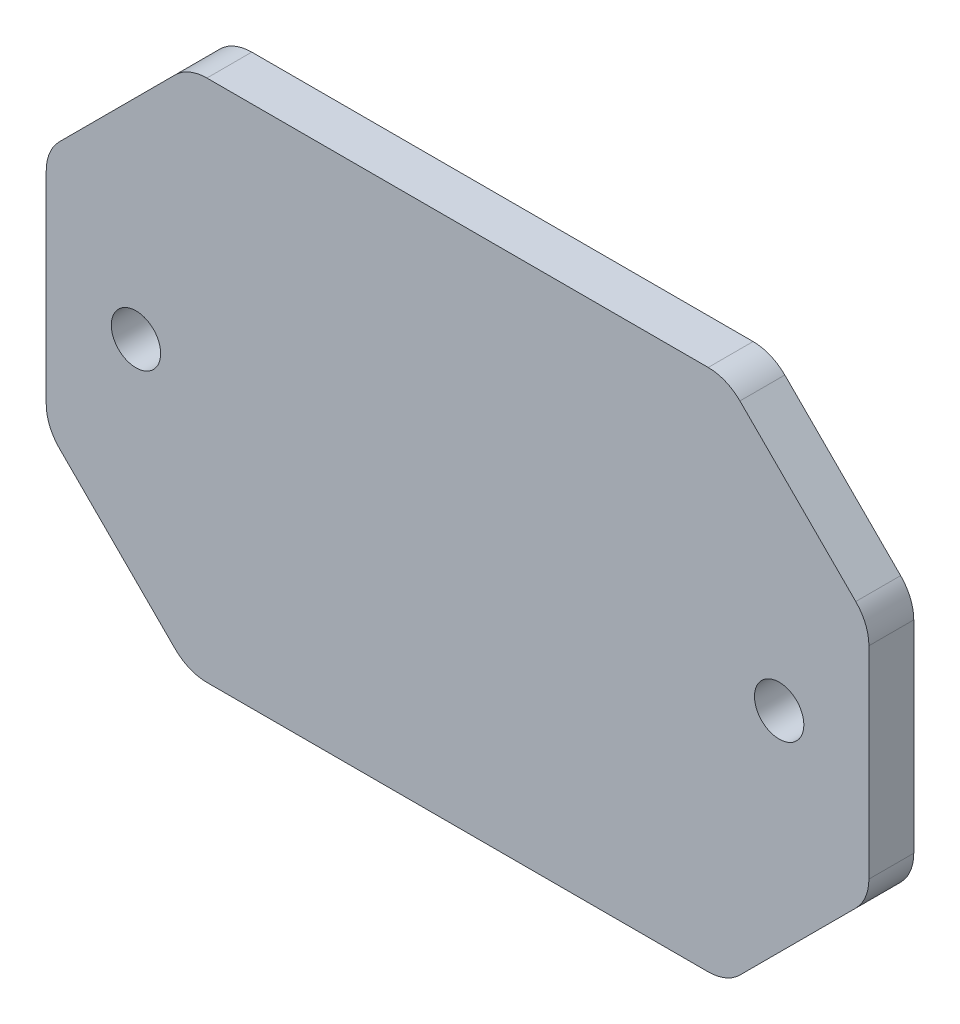
ISO-10303-21;
HEADER;
FILE_DESCRIPTION(('STEP AP214'),'2;1');
FILE_NAME('part.step','',(''),(''),'','','');
FILE_SCHEMA(('AUTOMOTIVE_DESIGN { 1 0 10303 214 1 1 1 1 }'));
ENDSEC;
DATA;
#1=APPLICATION_CONTEXT('core data for automotive mechanical design processes');
#2=APPLICATION_PROTOCOL_DEFINITION('international standard','automotive_design',2000,#1);
#3=PRODUCT_CONTEXT('',#1,'mechanical');
#4=PRODUCT('Part','Part','',(#3));
#5=PRODUCT_RELATED_PRODUCT_CATEGORY('part','',(#4));
#6=PRODUCT_DEFINITION_FORMATION('','',#4);
#7=PRODUCT_DEFINITION_CONTEXT('part definition',#1,'design');
#8=PRODUCT_DEFINITION('design','',#6,#7);
#9=PRODUCT_DEFINITION_SHAPE('','',#8);
#10=(LENGTH_UNIT() NAMED_UNIT(*) SI_UNIT(.MILLI.,.METRE.));
#11=(NAMED_UNIT(*) PLANE_ANGLE_UNIT() SI_UNIT($,.RADIAN.));
#12=(NAMED_UNIT(*) SI_UNIT($,.STERADIAN.) SOLID_ANGLE_UNIT());
#13=UNCERTAINTY_MEASURE_WITH_UNIT(LENGTH_MEASURE(1.E-05),#10,'distance_accuracy_value','');
#14=(GEOMETRIC_REPRESENTATION_CONTEXT(3) GLOBAL_UNCERTAINTY_ASSIGNED_CONTEXT((#13)) GLOBAL_UNIT_ASSIGNED_CONTEXT((#10,
#11,#12)) REPRESENTATION_CONTEXT('',''));
#15=CARTESIAN_POINT('',(0.,0.,0.));
#16=DIRECTION('',(0.,0.,1.));
#17=DIRECTION('',(1.,0.,0.));
#18=AXIS2_PLACEMENT_3D('',#15,#16,#17);
#19=CARTESIAN_POINT('',(27.5,17.4980916030534,3.));
#20=DIRECTION('',(-1.,0.,0.));
#21=DIRECTION('',(0.,-1.,0.));
#22=AXIS2_PLACEMENT_3D('',#19,#20,#21);
#23=PLANE('',#22);
#24=DIRECTION('',(0.,1.,0.));
#25=VECTOR('',#24,1.);
#26=CARTESIAN_POINT('',(27.5,17.4980916030534,3.));
#27=LINE('',#26,#25);
#28=CARTESIAN_POINT('',(27.5,-6.75545091593417,3.));
#29=VERTEX_POINT('',#28);
#30=CARTESIAN_POINT('',(27.5,6.75545091593413,3.));
#31=VERTEX_POINT('',#30);
#32=EDGE_CURVE('E269',#29,#31,#27,.T.);
#33=ORIENTED_EDGE('',*,*,#32,.F.);
#34=DIRECTION('',(0.,0.,1.));
#35=VECTOR('',#34,1.);
#36=CARTESIAN_POINT('',(27.5,-6.75545091593417,0.));
#37=LINE('',#36,#35);
#38=CARTESIAN_POINT('',(27.5,-6.75545091593417,0.));
#39=VERTEX_POINT('',#38);
#40=EDGE_CURVE('E224',#29,#39,#37,.F.);
#41=ORIENTED_EDGE('',*,*,#40,.T.);
#42=DIRECTION('',(0.,1.,0.));
#43=VECTOR('',#42,1.);
#44=CARTESIAN_POINT('',(27.5,17.4980916030534,0.));
#45=LINE('',#44,#43);
#46=CARTESIAN_POINT('',(27.5,6.75545091593413,0.));
#47=VERTEX_POINT('',#46);
#48=EDGE_CURVE('E291',#39,#47,#45,.T.);
#49=ORIENTED_EDGE('',*,*,#48,.T.);
#50=DIRECTION('',(0.,0.,-1.));
#51=VECTOR('',#50,1.);
#52=CARTESIAN_POINT('',(27.5,6.75545091593413,3.));
#53=LINE('',#52,#51);
#54=EDGE_CURVE('E221',#47,#31,#53,.F.);
#55=ORIENTED_EDGE('',*,*,#54,.T.);
#56=EDGE_LOOP('',(#33,#41,#49,#55));
#57=FACE_BOUND('',#56,.T.);
#58=ADVANCED_FACE('F36',(#57),#23,.F.);
#59=CARTESIAN_POINT('',(-27.5,17.4980916030534,3.));
#60=DIRECTION('',(0.,-1.,0.));
#61=DIRECTION('',(0.,0.,-1.));
#62=AXIS2_PLACEMENT_3D('',#59,#60,#61);
#63=PLANE('',#62);
#64=DIRECTION('',(-1.,0.,0.));
#65=VECTOR('',#64,1.);
#66=CARTESIAN_POINT('',(-27.5,17.4980916030534,3.));
#67=LINE('',#66,#65);
#68=CARTESIAN_POINT('',(16.7573593128807,17.4980916030534,3.));
#69=VERTEX_POINT('',#68);
#70=CARTESIAN_POINT('',(-16.7573593128807,17.4980916030534,3.));
#71=VERTEX_POINT('',#70);
#72=EDGE_CURVE('E173',#69,#71,#67,.T.);
#73=ORIENTED_EDGE('',*,*,#72,.F.);
#74=DIRECTION('',(0.,0.,1.));
#75=VECTOR('',#74,1.);
#76=CARTESIAN_POINT('',(16.7573593128807,17.4980916030534,0.));
#77=LINE('',#76,#75);
#78=CARTESIAN_POINT('',(16.7573593128807,17.4980916030534,0.));
#79=VERTEX_POINT('',#78);
#80=EDGE_CURVE('E234',#69,#79,#77,.F.);
#81=ORIENTED_EDGE('',*,*,#80,.T.);
#82=DIRECTION('',(-1.,0.,0.));
#83=VECTOR('',#82,1.);
#84=CARTESIAN_POINT('',(-27.5,17.4980916030534,0.));
#85=LINE('',#84,#83);
#86=CARTESIAN_POINT('',(-16.7573593128807,17.4980916030534,0.));
#87=VERTEX_POINT('',#86);
#88=EDGE_CURVE('E274',#79,#87,#85,.T.);
#89=ORIENTED_EDGE('',*,*,#88,.T.);
#90=DIRECTION('',(0.,0.,-1.));
#91=VECTOR('',#90,1.);
#92=CARTESIAN_POINT('',(-16.7573593128807,17.4980916030534,3.));
#93=LINE('',#92,#91);
#94=EDGE_CURVE('E231',#87,#71,#93,.F.);
#95=ORIENTED_EDGE('',*,*,#94,.T.);
#96=EDGE_LOOP('',(#73,#81,#89,#95));
#97=FACE_BOUND('',#96,.T.);
#98=ADVANCED_FACE('F299',(#97),#63,.F.);
#99=CARTESIAN_POINT('',(-27.5,17.4980916030534,3.));
#100=DIRECTION('',(1.,0.,0.));
#101=DIRECTION('',(0.,1.,0.));
#102=AXIS2_PLACEMENT_3D('',#99,#100,#101);
#103=PLANE('',#102);
#104=DIRECTION('',(0.,-1.,0.));
#105=VECTOR('',#104,1.);
#106=CARTESIAN_POINT('',(-27.5,17.4980916030534,0.));
#107=LINE('',#106,#105);
#108=CARTESIAN_POINT('',(-27.5,6.75545091593416,0.));
#109=VERTEX_POINT('',#108);
#110=CARTESIAN_POINT('',(-27.5,-6.75545091593414,0.));
#111=VERTEX_POINT('',#110);
#112=EDGE_CURVE('E270',#109,#111,#107,.T.);
#113=ORIENTED_EDGE('',*,*,#112,.T.);
#114=DIRECTION('',(0.,0.,-1.));
#115=VECTOR('',#114,1.);
#116=CARTESIAN_POINT('',(-27.5,-6.75545091593414,3.));
#117=LINE('',#116,#115);
#118=CARTESIAN_POINT('',(-27.5,-6.75545091593414,3.));
#119=VERTEX_POINT('',#118);
#120=EDGE_CURVE('E162',#111,#119,#117,.F.);
#121=ORIENTED_EDGE('',*,*,#120,.T.);
#122=DIRECTION('',(0.,-1.,0.));
#123=VECTOR('',#122,1.);
#124=CARTESIAN_POINT('',(-27.5,17.4980916030534,3.));
#125=LINE('',#124,#123);
#126=CARTESIAN_POINT('',(-27.5,6.75545091593416,3.));
#127=VERTEX_POINT('',#126);
#128=EDGE_CURVE('E155',#127,#119,#125,.T.);
#129=ORIENTED_EDGE('',*,*,#128,.F.);
#130=DIRECTION('',(0.,0.,1.));
#131=VECTOR('',#130,1.);
#132=CARTESIAN_POINT('',(-27.5,6.75545091593416,0.));
#133=LINE('',#132,#131);
#134=EDGE_CURVE('E169',#127,#109,#133,.F.);
#135=ORIENTED_EDGE('',*,*,#134,.T.);
#136=EDGE_LOOP('',(#113,#121,#129,#135));
#137=FACE_BOUND('',#136,.T.);
#138=ADVANCED_FACE('F168',(#137),#103,.F.);
#139=CARTESIAN_POINT('',(-27.5,-17.4980916030535,3.));
#140=DIRECTION('',(0.,1.,0.));
#141=DIRECTION('',(0.,0.,1.));
#142=AXIS2_PLACEMENT_3D('',#139,#140,#141);
#143=PLANE('',#142);
#144=DIRECTION('',(1.,0.,0.));
#145=VECTOR('',#144,1.);
#146=CARTESIAN_POINT('',(-27.5,-17.4980916030535,3.));
#147=LINE('',#146,#145);
#148=CARTESIAN_POINT('',(-16.7573593128807,-17.4980916030535,3.));
#149=VERTEX_POINT('',#148);
#150=CARTESIAN_POINT('',(16.7573593128807,-17.4980916030535,3.));
#151=VERTEX_POINT('',#150);
#152=EDGE_CURVE('E172',#149,#151,#147,.T.);
#153=ORIENTED_EDGE('',*,*,#152,.F.);
#154=DIRECTION('',(0.,0.,1.));
#155=VECTOR('',#154,1.);
#156=CARTESIAN_POINT('',(-16.7573593128807,-17.4980916030535,0.));
#157=LINE('',#156,#155);
#158=CARTESIAN_POINT('',(-16.7573593128807,-17.4980916030535,0.));
#159=VERTEX_POINT('',#158);
#160=EDGE_CURVE('E215',#149,#159,#157,.F.);
#161=ORIENTED_EDGE('',*,*,#160,.T.);
#162=DIRECTION('',(1.,0.,0.));
#163=VECTOR('',#162,1.);
#164=CARTESIAN_POINT('',(-27.5,-17.4980916030535,0.));
#165=LINE('',#164,#163);
#166=CARTESIAN_POINT('',(16.7573593128807,-17.4980916030535,0.));
#167=VERTEX_POINT('',#166);
#168=EDGE_CURVE('E265',#159,#167,#165,.T.);
#169=ORIENTED_EDGE('',*,*,#168,.T.);
#170=DIRECTION('',(0.,0.,-1.));
#171=VECTOR('',#170,1.);
#172=CARTESIAN_POINT('',(16.7573593128807,-17.4980916030535,3.));
#173=LINE('',#172,#171);
#174=EDGE_CURVE('E212',#167,#151,#173,.F.);
#175=ORIENTED_EDGE('',*,*,#174,.T.);
#176=EDGE_LOOP('',(#153,#161,#169,#175));
#177=FACE_BOUND('',#176,.T.);
#178=ADVANCED_FACE('F264',(#177),#143,.F.);
#179=CARTESIAN_POINT('',(0.,0.,3.));
#180=DIRECTION('',(0.,0.,1.));
#181=DIRECTION('',(1.,0.,0.));
#182=AXIS2_PLACEMENT_3D('',#179,#180,#181);
#183=PLANE('',#182);
#184=CARTESIAN_POINT('',(-21.5,0.,3.));
#185=DIRECTION('',(0.,0.,1.));
#186=DIRECTION('',(1.,0.,0.));
#187=AXIS2_PLACEMENT_3D('',#184,#185,#186);
#188=CIRCLE('',#187,1.65);
#189=CARTESIAN_POINT('',(-19.85,0.,3.));
#190=VERTEX_POINT('',#189);
#191=EDGE_CURVE('E312',#190,#190,#188,.T.);
#192=ORIENTED_EDGE('',*,*,#191,.F.);
#193=EDGE_LOOP('',(#192));
#194=FACE_BOUND('',#193,.T.);
#195=CARTESIAN_POINT('',(21.5,0.,3.));
#196=DIRECTION('',(0.,0.,1.));
#197=DIRECTION('',(1.,0.,0.));
#198=AXIS2_PLACEMENT_3D('',#195,#196,#197);
#199=CIRCLE('',#198,1.65);
#200=CARTESIAN_POINT('',(23.15,0.,3.));
#201=VERTEX_POINT('',#200);
#202=EDGE_CURVE('E306',#201,#201,#199,.T.);
#203=ORIENTED_EDGE('',*,*,#202,.F.);
#204=EDGE_LOOP('',(#203));
#205=FACE_BOUND('',#204,.T.);
#206=ORIENTED_EDGE('',*,*,#128,.T.);
#207=CARTESIAN_POINT('',(-24.5,-6.75545091593414,3.));
#208=DIRECTION('',(0.,0.,1.));
#209=DIRECTION('',(1.,0.,0.));
#210=AXIS2_PLACEMENT_3D('',#207,#208,#209);
#211=CIRCLE('',#210,3.);
#212=CARTESIAN_POINT('',(-26.6213203435596,-8.87677125949378,3.));
#213=VERTEX_POINT('',#212);
#214=EDGE_CURVE('E193',#119,#213,#211,.T.);
#215=ORIENTED_EDGE('',*,*,#214,.T.);
#216=DIRECTION('',(-0.707106781186547,0.707106781186549,0.));
#217=VECTOR('',#216,1.);
#218=CARTESIAN_POINT('',(-17.7490458015267,-17.7490458015267,3.));
#219=LINE('',#218,#217);
#220=CARTESIAN_POINT('',(-18.8786796564403,-16.6194119466131,3.));
#221=VERTEX_POINT('',#220);
#222=EDGE_CURVE('E178',#213,#221,#219,.F.);
#223=ORIENTED_EDGE('',*,*,#222,.T.);
#224=CARTESIAN_POINT('',(-16.7573593128807,-14.4980916030535,3.));
#225=DIRECTION('',(0.,0.,1.));
#226=DIRECTION('',(1.,0.,0.));
#227=AXIS2_PLACEMENT_3D('',#224,#225,#226);
#228=CIRCLE('',#227,3.);
#229=EDGE_CURVE('E191',#221,#149,#228,.T.);
#230=ORIENTED_EDGE('',*,*,#229,.T.);
#231=ORIENTED_EDGE('',*,*,#152,.T.);
#232=CARTESIAN_POINT('',(16.7573593128807,-14.4980916030535,3.));
#233=DIRECTION('',(0.,0.,1.));
#234=DIRECTION('',(1.,0.,0.));
#235=AXIS2_PLACEMENT_3D('',#232,#233,#234);
#236=CIRCLE('',#235,3.);
#237=CARTESIAN_POINT('',(18.8786796564403,-16.6194119466131,3.));
#238=VERTEX_POINT('',#237);
#239=EDGE_CURVE('E189',#151,#238,#236,.T.);
#240=ORIENTED_EDGE('',*,*,#239,.T.);
#241=DIRECTION('',(-0.707106781186549,-0.707106781186546,0.));
#242=VECTOR('',#241,1.);
#243=CARTESIAN_POINT('',(17.7490458015267,-17.7490458015267,3.));
#244=LINE('',#243,#242);
#245=CARTESIAN_POINT('',(26.6213203435596,-8.87677125949381,3.));
#246=VERTEX_POINT('',#245);
#247=EDGE_CURVE('E247',#238,#246,#244,.F.);
#248=ORIENTED_EDGE('',*,*,#247,.T.);
#249=CARTESIAN_POINT('',(24.5,-6.75545091593417,3.));
#250=DIRECTION('',(0.,0.,1.));
#251=DIRECTION('',(1.,0.,0.));
#252=AXIS2_PLACEMENT_3D('',#249,#250,#251);
#253=CIRCLE('',#252,3.);
#254=EDGE_CURVE('E187',#246,#29,#253,.T.);
#255=ORIENTED_EDGE('',*,*,#254,.T.);
#256=ORIENTED_EDGE('',*,*,#32,.T.);
#257=CARTESIAN_POINT('',(24.5,6.75545091593412,3.));
#258=DIRECTION('',(0.,0.,1.));
#259=DIRECTION('',(1.,0.,0.));
#260=AXIS2_PLACEMENT_3D('',#257,#258,#259);
#261=CIRCLE('',#260,3.);
#262=CARTESIAN_POINT('',(26.6213203435597,8.87677125949376,3.));
#263=VERTEX_POINT('',#262);
#264=EDGE_CURVE('E185',#31,#263,#261,.T.);
#265=ORIENTED_EDGE('',*,*,#264,.T.);
#266=DIRECTION('',(0.707106781186546,-0.707106781186549,0.));
#267=VECTOR('',#266,1.);
#268=CARTESIAN_POINT('',(17.7490458015268,17.7490458015267,3.));
#269=LINE('',#268,#267);
#270=CARTESIAN_POINT('',(18.8786796564404,16.6194119466131,3.));
#271=VERTEX_POINT('',#270);
#272=EDGE_CURVE('E243',#263,#271,#269,.F.);
#273=ORIENTED_EDGE('',*,*,#272,.T.);
#274=CARTESIAN_POINT('',(16.7573593128807,14.4980916030534,3.));
#275=DIRECTION('',(0.,0.,1.));
#276=DIRECTION('',(1.,0.,0.));
#277=AXIS2_PLACEMENT_3D('',#274,#275,#276);
#278=CIRCLE('',#277,3.);
#279=EDGE_CURVE('E183',#271,#69,#278,.T.);
#280=ORIENTED_EDGE('',*,*,#279,.T.);
#281=ORIENTED_EDGE('',*,*,#72,.T.);
#282=CARTESIAN_POINT('',(-16.7573593128807,14.4980916030534,3.));
#283=DIRECTION('',(0.,0.,1.));
#284=DIRECTION('',(1.,0.,0.));
#285=AXIS2_PLACEMENT_3D('',#282,#283,#284);
#286=CIRCLE('',#285,3.);
#287=CARTESIAN_POINT('',(-18.8786796564403,16.6194119466131,3.));
#288=VERTEX_POINT('',#287);
#289=EDGE_CURVE('E161',#71,#288,#286,.T.);
#290=ORIENTED_EDGE('',*,*,#289,.T.);
#291=DIRECTION('',(0.707106781186549,0.707106781186546,0.));
#292=VECTOR('',#291,1.);
#293=CARTESIAN_POINT('',(-17.7490458015267,17.7490458015267,3.));
#294=LINE('',#293,#292);
#295=CARTESIAN_POINT('',(-26.6213203435596,8.87677125949381,3.));
#296=VERTEX_POINT('',#295);
#297=EDGE_CURVE('E157',#288,#296,#294,.F.);
#298=ORIENTED_EDGE('',*,*,#297,.T.);
#299=CARTESIAN_POINT('',(-24.5,6.75545091593416,3.));
#300=DIRECTION('',(0.,0.,1.));
#301=DIRECTION('',(1.,0.,0.));
#302=AXIS2_PLACEMENT_3D('',#299,#300,#301);
#303=CIRCLE('',#302,3.);
#304=EDGE_CURVE('E152',#296,#127,#303,.T.);
#305=ORIENTED_EDGE('',*,*,#304,.T.);
#306=EDGE_LOOP('',(#206,#215,#223,#230,#231,#240,#248,#255,#256,#265,#273,#280,#281,#290,#298,#305));
#307=FACE_BOUND('',#306,.T.);
#308=ADVANCED_FACE('F154',(#194,#205,#307),#183,.T.);
#309=CARTESIAN_POINT('',(0.,0.,0.));
#310=DIRECTION('',(0.,0.,1.));
#311=DIRECTION('',(1.,0.,0.));
#312=AXIS2_PLACEMENT_3D('',#309,#310,#311);
#313=PLANE('',#312);
#314=CARTESIAN_POINT('',(-21.5,0.,0.));
#315=DIRECTION('',(0.,0.,1.));
#316=DIRECTION('',(1.,0.,0.));
#317=AXIS2_PLACEMENT_3D('',#314,#315,#316);
#318=CIRCLE('',#317,1.65);
#319=CARTESIAN_POINT('',(-19.85,0.,0.));
#320=VERTEX_POINT('',#319);
#321=EDGE_CURVE('E293',#320,#320,#318,.T.);
#322=ORIENTED_EDGE('',*,*,#321,.T.);
#323=EDGE_LOOP('',(#322));
#324=FACE_BOUND('',#323,.T.);
#325=CARTESIAN_POINT('',(21.5,0.,0.));
#326=DIRECTION('',(0.,0.,1.));
#327=DIRECTION('',(1.,0.,0.));
#328=AXIS2_PLACEMENT_3D('',#325,#326,#327);
#329=CIRCLE('',#328,1.65);
#330=CARTESIAN_POINT('',(23.15,0.,0.));
#331=VERTEX_POINT('',#330);
#332=EDGE_CURVE('E309',#331,#331,#329,.T.);
#333=ORIENTED_EDGE('',*,*,#332,.T.);
#334=EDGE_LOOP('',(#333));
#335=FACE_BOUND('',#334,.T.);
#336=DIRECTION('',(0.707106781186547,-0.707106781186549,0.));
#337=VECTOR('',#336,1.);
#338=CARTESIAN_POINT('',(-18.,-17.4980916030535,0.));
#339=LINE('',#338,#337);
#340=CARTESIAN_POINT('',(-18.8786796564403,-16.6194119466131,0.));
#341=VERTEX_POINT('',#340);
#342=CARTESIAN_POINT('',(-26.6213203435596,-8.87677125949378,0.));
#343=VERTEX_POINT('',#342);
#344=EDGE_CURVE('E244',#341,#343,#339,.F.);
#345=ORIENTED_EDGE('',*,*,#344,.T.);
#346=CARTESIAN_POINT('',(-24.5,-6.75545091593414,0.));
#347=DIRECTION('',(0.,0.,1.));
#348=DIRECTION('',(1.,0.,0.));
#349=AXIS2_PLACEMENT_3D('',#346,#347,#348);
#350=CIRCLE('',#349,3.);
#351=EDGE_CURVE('E210',#343,#111,#350,.F.);
#352=ORIENTED_EDGE('',*,*,#351,.T.);
#353=ORIENTED_EDGE('',*,*,#112,.F.);
#354=CARTESIAN_POINT('',(-24.5,6.75545091593416,0.));
#355=DIRECTION('',(0.,0.,1.));
#356=DIRECTION('',(1.,0.,0.));
#357=AXIS2_PLACEMENT_3D('',#354,#355,#356);
#358=CIRCLE('',#357,3.);
#359=CARTESIAN_POINT('',(-26.6213203435596,8.8767712594938,0.));
#360=VERTEX_POINT('',#359);
#361=EDGE_CURVE('E175',#109,#360,#358,.F.);
#362=ORIENTED_EDGE('',*,*,#361,.T.);
#363=DIRECTION('',(-0.707106781186549,-0.707106781186546,0.));
#364=VECTOR('',#363,1.);
#365=CARTESIAN_POINT('',(-27.5,7.99809160305345,0.));
#366=LINE('',#365,#364);
#367=CARTESIAN_POINT('',(-18.8786796564403,16.6194119466131,0.));
#368=VERTEX_POINT('',#367);
#369=EDGE_CURVE('E241',#360,#368,#366,.F.);
#370=ORIENTED_EDGE('',*,*,#369,.T.);
#371=CARTESIAN_POINT('',(-16.7573593128807,14.4980916030534,0.));
#372=DIRECTION('',(0.,0.,1.));
#373=DIRECTION('',(1.,0.,0.));
#374=AXIS2_PLACEMENT_3D('',#371,#372,#373);
#375=CIRCLE('',#374,3.);
#376=EDGE_CURVE('E200',#368,#87,#375,.F.);
#377=ORIENTED_EDGE('',*,*,#376,.T.);
#378=ORIENTED_EDGE('',*,*,#88,.F.);
#379=CARTESIAN_POINT('',(16.7573593128807,14.4980916030534,0.));
#380=DIRECTION('',(0.,0.,1.));
#381=DIRECTION('',(1.,0.,0.));
#382=AXIS2_PLACEMENT_3D('',#379,#380,#381);
#383=CIRCLE('',#382,3.);
#384=CARTESIAN_POINT('',(18.8786796564404,16.6194119466131,0.));
#385=VERTEX_POINT('',#384);
#386=EDGE_CURVE('E202',#79,#385,#383,.F.);
#387=ORIENTED_EDGE('',*,*,#386,.T.);
#388=DIRECTION('',(-0.707106781186546,0.707106781186549,0.));
#389=VECTOR('',#388,1.);
#390=CARTESIAN_POINT('',(18.,17.4980916030534,0.));
#391=LINE('',#390,#389);
#392=CARTESIAN_POINT('',(26.6213203435597,8.87677125949376,0.));
#393=VERTEX_POINT('',#392);
#394=EDGE_CURVE('E278',#385,#393,#391,.F.);
#395=ORIENTED_EDGE('',*,*,#394,.T.);
#396=CARTESIAN_POINT('',(24.5,6.75545091593412,0.));
#397=DIRECTION('',(0.,0.,1.));
#398=DIRECTION('',(1.,0.,0.));
#399=AXIS2_PLACEMENT_3D('',#396,#397,#398);
#400=CIRCLE('',#399,3.);
#401=EDGE_CURVE('E204',#393,#47,#400,.F.);
#402=ORIENTED_EDGE('',*,*,#401,.T.);
#403=ORIENTED_EDGE('',*,*,#48,.F.);
#404=CARTESIAN_POINT('',(24.5,-6.75545091593417,0.));
#405=DIRECTION('',(0.,0.,1.));
#406=DIRECTION('',(1.,0.,0.));
#407=AXIS2_PLACEMENT_3D('',#404,#405,#406);
#408=CIRCLE('',#407,3.);
#409=CARTESIAN_POINT('',(26.6213203435596,-8.87677125949382,0.));
#410=VERTEX_POINT('',#409);
#411=EDGE_CURVE('E206',#39,#410,#408,.F.);
#412=ORIENTED_EDGE('',*,*,#411,.T.);
#413=DIRECTION('',(0.707106781186549,0.707106781186546,0.));
#414=VECTOR('',#413,1.);
#415=CARTESIAN_POINT('',(27.5,-7.99809160305346,0.));
#416=LINE('',#415,#414);
#417=CARTESIAN_POINT('',(18.8786796564403,-16.6194119466131,0.));
#418=VERTEX_POINT('',#417);
#419=EDGE_CURVE('E250',#410,#418,#416,.F.);
#420=ORIENTED_EDGE('',*,*,#419,.T.);
#421=CARTESIAN_POINT('',(16.7573593128807,-14.4980916030535,0.));
#422=DIRECTION('',(0.,0.,1.));
#423=DIRECTION('',(1.,0.,0.));
#424=AXIS2_PLACEMENT_3D('',#421,#422,#423);
#425=CIRCLE('',#424,3.);
#426=EDGE_CURVE('E51',#418,#167,#425,.F.);
#427=ORIENTED_EDGE('',*,*,#426,.T.);
#428=ORIENTED_EDGE('',*,*,#168,.F.);
#429=CARTESIAN_POINT('',(-16.7573593128807,-14.4980916030535,0.));
#430=DIRECTION('',(0.,0.,1.));
#431=DIRECTION('',(1.,0.,0.));
#432=AXIS2_PLACEMENT_3D('',#429,#430,#431);
#433=CIRCLE('',#432,3.);
#434=EDGE_CURVE('E59',#159,#341,#433,.F.);
#435=ORIENTED_EDGE('',*,*,#434,.T.);
#436=EDGE_LOOP('',(#345,#352,#353,#362,#370,#377,#378,#387,#395,#402,#403,#412,#420,#427,#428,#435));
#437=FACE_BOUND('',#436,.T.);
#438=ADVANCED_FACE('F267',(#324,#335,#437),#313,.F.);
#439=CARTESIAN_POINT('',(-27.5,7.99809160305345,3.));
#440=DIRECTION('',(0.707106781186546,-0.707106781186549,0.));
#441=DIRECTION('',(0.,0.,-1.));
#442=AXIS2_PLACEMENT_3D('',#439,#440,#441);
#443=PLANE('',#442);
#444=ORIENTED_EDGE('',*,*,#297,.F.);
#445=DIRECTION('',(0.,0.,1.));
#446=VECTOR('',#445,1.);
#447=CARTESIAN_POINT('',(-18.8786796564403,16.6194119466131,0.));
#448=LINE('',#447,#446);
#449=EDGE_CURVE('E11',#288,#368,#448,.F.);
#450=ORIENTED_EDGE('',*,*,#449,.T.);
#451=ORIENTED_EDGE('',*,*,#369,.F.);
#452=DIRECTION('',(0.,0.,-1.));
#453=VECTOR('',#452,1.);
#454=CARTESIAN_POINT('',(-26.6213203435596,8.8767712594938,3.));
#455=LINE('',#454,#453);
#456=EDGE_CURVE('E44',#360,#296,#455,.F.);
#457=ORIENTED_EDGE('',*,*,#456,.T.);
#458=EDGE_LOOP('',(#444,#450,#451,#457));
#459=FACE_BOUND('',#458,.T.);
#460=ADVANCED_FACE('F238',(#459),#443,.F.);
#461=CARTESIAN_POINT('',(-18.,-17.4980916030535,3.));
#462=DIRECTION('',(0.707106781186548,0.707106781186546,0.));
#463=DIRECTION('',(0.,0.,-1.));
#464=AXIS2_PLACEMENT_3D('',#461,#462,#463);
#465=PLANE('',#464);
#466=ORIENTED_EDGE('',*,*,#222,.F.);
#467=DIRECTION('',(0.,0.,1.));
#468=VECTOR('',#467,1.);
#469=CARTESIAN_POINT('',(-26.6213203435596,-8.87677125949378,0.));
#470=LINE('',#469,#468);
#471=EDGE_CURVE('E197',#213,#343,#470,.F.);
#472=ORIENTED_EDGE('',*,*,#471,.T.);
#473=ORIENTED_EDGE('',*,*,#344,.F.);
#474=DIRECTION('',(0.,0.,-1.));
#475=VECTOR('',#474,1.);
#476=CARTESIAN_POINT('',(-18.8786796564403,-16.6194119466131,3.));
#477=LINE('',#476,#475);
#478=EDGE_CURVE('E195',#341,#221,#477,.F.);
#479=ORIENTED_EDGE('',*,*,#478,.T.);
#480=EDGE_LOOP('',(#466,#472,#473,#479));
#481=FACE_BOUND('',#480,.T.);
#482=ADVANCED_FACE('F355',(#481),#465,.F.);
#483=CARTESIAN_POINT('',(27.5,-7.99809160305346,3.));
#484=DIRECTION('',(-0.707106781186546,0.707106781186549,0.));
#485=DIRECTION('',(0.,0.,-1.));
#486=AXIS2_PLACEMENT_3D('',#483,#484,#485);
#487=PLANE('',#486);
#488=ORIENTED_EDGE('',*,*,#247,.F.);
#489=DIRECTION('',(0.,0.,1.));
#490=VECTOR('',#489,1.);
#491=CARTESIAN_POINT('',(18.8786796564403,-16.6194119466131,0.));
#492=LINE('',#491,#490);
#493=EDGE_CURVE('E219',#238,#418,#492,.F.);
#494=ORIENTED_EDGE('',*,*,#493,.T.);
#495=ORIENTED_EDGE('',*,*,#419,.F.);
#496=DIRECTION('',(0.,0.,-1.));
#497=VECTOR('',#496,1.);
#498=CARTESIAN_POINT('',(26.6213203435596,-8.87677125949382,3.));
#499=LINE('',#498,#497);
#500=EDGE_CURVE('E217',#410,#246,#499,.F.);
#501=ORIENTED_EDGE('',*,*,#500,.T.);
#502=EDGE_LOOP('',(#488,#494,#495,#501));
#503=FACE_BOUND('',#502,.T.);
#504=ADVANCED_FACE('F361',(#503),#487,.F.);
#505=CARTESIAN_POINT('',(18.,17.4980916030534,3.));
#506=DIRECTION('',(-0.707106781186549,-0.707106781186546,0.));
#507=DIRECTION('',(0.,0.,-1.));
#508=AXIS2_PLACEMENT_3D('',#505,#506,#507);
#509=PLANE('',#508);
#510=ORIENTED_EDGE('',*,*,#272,.F.);
#511=DIRECTION('',(0.,0.,1.));
#512=VECTOR('',#511,1.);
#513=CARTESIAN_POINT('',(26.6213203435597,8.87677125949376,0.));
#514=LINE('',#513,#512);
#515=EDGE_CURVE('E229',#263,#393,#514,.F.);
#516=ORIENTED_EDGE('',*,*,#515,.T.);
#517=ORIENTED_EDGE('',*,*,#394,.F.);
#518=DIRECTION('',(0.,0.,-1.));
#519=VECTOR('',#518,1.);
#520=CARTESIAN_POINT('',(18.8786796564404,16.6194119466131,3.));
#521=LINE('',#520,#519);
#522=EDGE_CURVE('E227',#385,#271,#521,.F.);
#523=ORIENTED_EDGE('',*,*,#522,.T.);
#524=EDGE_LOOP('',(#510,#516,#517,#523));
#525=FACE_BOUND('',#524,.T.);
#526=ADVANCED_FACE('F367',(#525),#509,.F.);
#527=CARTESIAN_POINT('',(-24.5,-6.75545091593414,3.));
#528=DIRECTION('',(0.,0.,1.));
#529=DIRECTION('',(1.,0.,0.));
#530=AXIS2_PLACEMENT_3D('',#527,#528,#529);
#531=CYLINDRICAL_SURFACE('',#530,3.);
#532=ORIENTED_EDGE('',*,*,#351,.F.);
#533=ORIENTED_EDGE('',*,*,#471,.F.);
#534=ORIENTED_EDGE('',*,*,#214,.F.);
#535=ORIENTED_EDGE('',*,*,#120,.F.);
#536=EDGE_LOOP('',(#532,#533,#534,#535));
#537=FACE_BOUND('',#536,.T.);
#538=ADVANCED_FACE('F372',(#537),#531,.T.);
#539=CARTESIAN_POINT('',(-16.7573593128807,-14.4980916030535,3.));
#540=DIRECTION('',(0.,0.,-1.));
#541=DIRECTION('',(-1.,0.,0.));
#542=AXIS2_PLACEMENT_3D('',#539,#540,#541);
#543=CYLINDRICAL_SURFACE('',#542,3.);
#544=ORIENTED_EDGE('',*,*,#229,.F.);
#545=ORIENTED_EDGE('',*,*,#478,.F.);
#546=ORIENTED_EDGE('',*,*,#434,.F.);
#547=ORIENTED_EDGE('',*,*,#160,.F.);
#548=EDGE_LOOP('',(#544,#545,#546,#547));
#549=FACE_BOUND('',#548,.T.);
#550=ADVANCED_FACE('F262',(#549),#543,.T.);
#551=CARTESIAN_POINT('',(16.7573593128807,-14.4980916030535,3.));
#552=DIRECTION('',(0.,0.,1.));
#553=DIRECTION('',(1.,0.,0.));
#554=AXIS2_PLACEMENT_3D('',#551,#552,#553);
#555=CYLINDRICAL_SURFACE('',#554,3.);
#556=ORIENTED_EDGE('',*,*,#426,.F.);
#557=ORIENTED_EDGE('',*,*,#493,.F.);
#558=ORIENTED_EDGE('',*,*,#239,.F.);
#559=ORIENTED_EDGE('',*,*,#174,.F.);
#560=EDGE_LOOP('',(#556,#557,#558,#559));
#561=FACE_BOUND('',#560,.T.);
#562=ADVANCED_FACE('F286',(#561),#555,.T.);
#563=CARTESIAN_POINT('',(24.5,-6.75545091593417,3.));
#564=DIRECTION('',(0.,0.,-1.));
#565=DIRECTION('',(-1.,0.,0.));
#566=AXIS2_PLACEMENT_3D('',#563,#564,#565);
#567=CYLINDRICAL_SURFACE('',#566,3.);
#568=ORIENTED_EDGE('',*,*,#254,.F.);
#569=ORIENTED_EDGE('',*,*,#500,.F.);
#570=ORIENTED_EDGE('',*,*,#411,.F.);
#571=ORIENTED_EDGE('',*,*,#40,.F.);
#572=EDGE_LOOP('',(#568,#569,#570,#571));
#573=FACE_BOUND('',#572,.T.);
#574=ADVANCED_FACE('F381',(#573),#567,.T.);
#575=CARTESIAN_POINT('',(24.5,6.75545091593412,3.));
#576=DIRECTION('',(0.,0.,1.));
#577=DIRECTION('',(1.,0.,0.));
#578=AXIS2_PLACEMENT_3D('',#575,#576,#577);
#579=CYLINDRICAL_SURFACE('',#578,3.);
#580=ORIENTED_EDGE('',*,*,#401,.F.);
#581=ORIENTED_EDGE('',*,*,#515,.F.);
#582=ORIENTED_EDGE('',*,*,#264,.F.);
#583=ORIENTED_EDGE('',*,*,#54,.F.);
#584=EDGE_LOOP('',(#580,#581,#582,#583));
#585=FACE_BOUND('',#584,.T.);
#586=ADVANCED_FACE('F384',(#585),#579,.T.);
#587=CARTESIAN_POINT('',(16.7573593128807,14.4980916030534,3.));
#588=DIRECTION('',(0.,0.,-1.));
#589=DIRECTION('',(-1.,0.,0.));
#590=AXIS2_PLACEMENT_3D('',#587,#588,#589);
#591=CYLINDRICAL_SURFACE('',#590,3.);
#592=ORIENTED_EDGE('',*,*,#279,.F.);
#593=ORIENTED_EDGE('',*,*,#522,.F.);
#594=ORIENTED_EDGE('',*,*,#386,.F.);
#595=ORIENTED_EDGE('',*,*,#80,.F.);
#596=EDGE_LOOP('',(#592,#593,#594,#595));
#597=FACE_BOUND('',#596,.T.);
#598=ADVANCED_FACE('F388',(#597),#591,.T.);
#599=CARTESIAN_POINT('',(-16.7573593128807,14.4980916030534,3.));
#600=DIRECTION('',(0.,0.,1.));
#601=DIRECTION('',(1.,0.,0.));
#602=AXIS2_PLACEMENT_3D('',#599,#600,#601);
#603=CYLINDRICAL_SURFACE('',#602,3.);
#604=ORIENTED_EDGE('',*,*,#376,.F.);
#605=ORIENTED_EDGE('',*,*,#449,.F.);
#606=ORIENTED_EDGE('',*,*,#289,.F.);
#607=ORIENTED_EDGE('',*,*,#94,.F.);
#608=EDGE_LOOP('',(#604,#605,#606,#607));
#609=FACE_BOUND('',#608,.T.);
#610=ADVANCED_FACE('F303',(#609),#603,.T.);
#611=CARTESIAN_POINT('',(-24.5,6.75545091593416,3.));
#612=DIRECTION('',(0.,0.,-1.));
#613=DIRECTION('',(-1.,0.,0.));
#614=AXIS2_PLACEMENT_3D('',#611,#612,#613);
#615=CYLINDRICAL_SURFACE('',#614,3.);
#616=ORIENTED_EDGE('',*,*,#304,.F.);
#617=ORIENTED_EDGE('',*,*,#456,.F.);
#618=ORIENTED_EDGE('',*,*,#361,.F.);
#619=ORIENTED_EDGE('',*,*,#134,.F.);
#620=EDGE_LOOP('',(#616,#617,#618,#619));
#621=FACE_BOUND('',#620,.T.);
#622=ADVANCED_FACE('F38',(#621),#615,.T.);
#623=CARTESIAN_POINT('',(21.5,0.,0.));
#624=DIRECTION('',(0.,0.,1.));
#625=DIRECTION('',(1.,0.,0.));
#626=AXIS2_PLACEMENT_3D('',#623,#624,#625);
#627=CYLINDRICAL_SURFACE('',#626,1.65);
#628=ORIENTED_EDGE('',*,*,#332,.F.);
#629=EDGE_LOOP('',(#628));
#630=FACE_BOUND('',#629,.T.);
#631=ORIENTED_EDGE('',*,*,#202,.T.);
#632=EDGE_LOOP('',(#631));
#633=FACE_BOUND('',#632,.T.);
#634=ADVANCED_FACE('F323',(#630,#633),#627,.F.);
#635=CARTESIAN_POINT('',(-21.5,0.,0.));
#636=DIRECTION('',(0.,0.,1.));
#637=DIRECTION('',(1.,0.,0.));
#638=AXIS2_PLACEMENT_3D('',#635,#636,#637);
#639=CYLINDRICAL_SURFACE('',#638,1.65);
#640=ORIENTED_EDGE('',*,*,#321,.F.);
#641=EDGE_LOOP('',(#640));
#642=FACE_BOUND('',#641,.T.);
#643=ORIENTED_EDGE('',*,*,#191,.T.);
#644=EDGE_LOOP('',(#643));
#645=FACE_BOUND('',#644,.T.);
#646=ADVANCED_FACE('F320',(#642,#645),#639,.F.);
#647=CLOSED_SHELL('',(#58,#98,#138,#178,#308,#438,#460,#482,#504,#526,#538,#550,#562,#574,#586,
#598,#610,#622,#634,#646));
#648=MANIFOLD_SOLID_BREP('B2',#647);
#649=ADVANCED_BREP_SHAPE_REPRESENTATION('',(#18,#648),#14);
#650=SHAPE_DEFINITION_REPRESENTATION(#9,#649);
ENDSEC;
END-ISO-10303-21;
